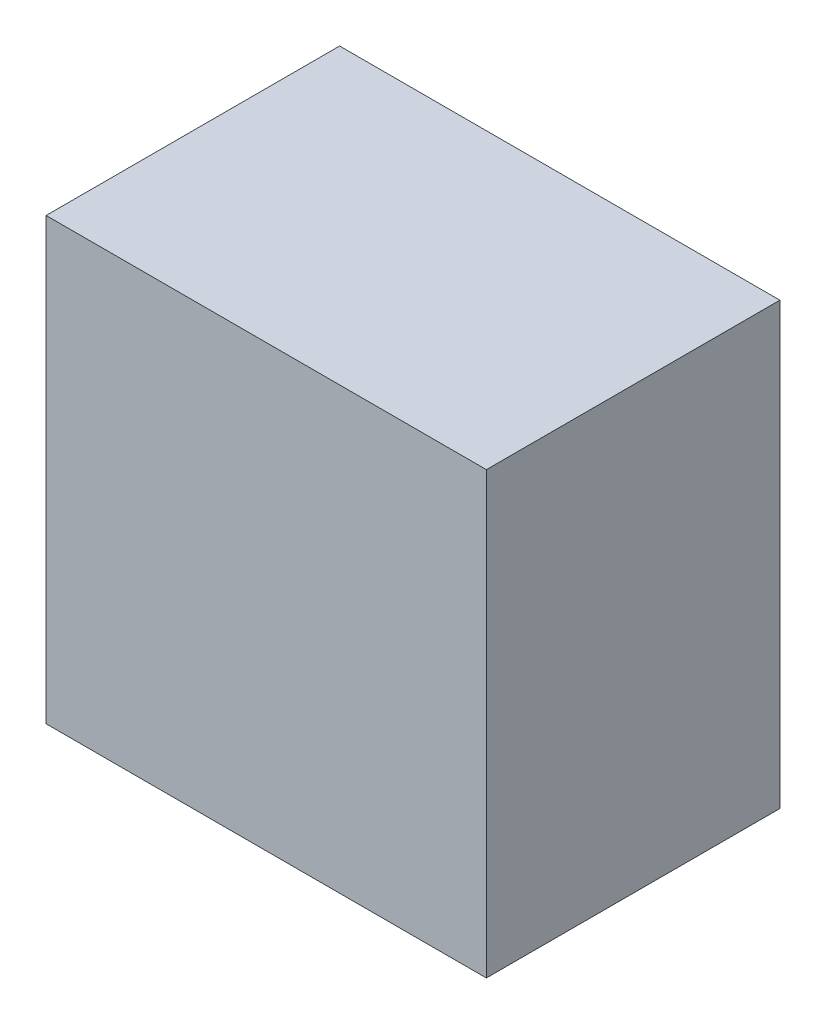
ISO-10303-21;
HEADER;
FILE_DESCRIPTION(('STEP AP214'),'2;1');
FILE_NAME('part.step','',(''),(''),'','','');
FILE_SCHEMA(('AUTOMOTIVE_DESIGN { 1 0 10303 214 1 1 1 1 }'));
ENDSEC;
DATA;
#1=APPLICATION_CONTEXT('core data for automotive mechanical design processes');
#2=APPLICATION_PROTOCOL_DEFINITION('international standard','automotive_design',2000,#1);
#3=PRODUCT_CONTEXT('',#1,'mechanical');
#4=PRODUCT('Part','Part','',(#3));
#5=PRODUCT_RELATED_PRODUCT_CATEGORY('part','',(#4));
#6=PRODUCT_DEFINITION_FORMATION('','',#4);
#7=PRODUCT_DEFINITION_CONTEXT('part definition',#1,'design');
#8=PRODUCT_DEFINITION('design','',#6,#7);
#9=PRODUCT_DEFINITION_SHAPE('','',#8);
#10=(LENGTH_UNIT() NAMED_UNIT(*) SI_UNIT(.MILLI.,.METRE.));
#11=(NAMED_UNIT(*) PLANE_ANGLE_UNIT() SI_UNIT($,.RADIAN.));
#12=(NAMED_UNIT(*) SI_UNIT($,.STERADIAN.) SOLID_ANGLE_UNIT());
#13=UNCERTAINTY_MEASURE_WITH_UNIT(LENGTH_MEASURE(1.E-05),#10,'distance_accuracy_value','');
#14=(GEOMETRIC_REPRESENTATION_CONTEXT(3) GLOBAL_UNCERTAINTY_ASSIGNED_CONTEXT((#13)) GLOBAL_UNIT_ASSIGNED_CONTEXT((#10,
#11,#12)) REPRESENTATION_CONTEXT('',''));
#15=CARTESIAN_POINT('',(0.,0.,0.));
#16=DIRECTION('',(0.,0.,1.));
#17=DIRECTION('',(1.,0.,0.));
#18=AXIS2_PLACEMENT_3D('',#15,#16,#17);
#19=CARTESIAN_POINT('',(0.,0.,0.));
#20=DIRECTION('',(0.,0.,1.));
#21=DIRECTION('',(1.,0.,0.));
#22=AXIS2_PLACEMENT_3D('',#19,#20,#21);
#23=PLANE('',#22);
#24=DIRECTION('',(0.,-1.,0.));
#25=VECTOR('',#24,1.);
#26=CARTESIAN_POINT('',(0.,0.,0.));
#27=LINE('',#26,#25);
#28=CARTESIAN_POINT('',(0.,0.,0.));
#29=VERTEX_POINT('',#28);
#30=CARTESIAN_POINT('',(0.,-15.,0.));
#31=VERTEX_POINT('',#30);
#32=EDGE_CURVE('E144',#29,#31,#27,.T.);
#33=ORIENTED_EDGE('',*,*,#32,.F.);
#34=DIRECTION('',(-1.,0.,0.));
#35=VECTOR('',#34,1.);
#36=CARTESIAN_POINT('',(0.,0.,0.));
#37=LINE('',#36,#35);
#38=CARTESIAN_POINT('',(15.,0.,0.));
#39=VERTEX_POINT('',#38);
#40=EDGE_CURVE('E87',#39,#29,#37,.T.);
#41=ORIENTED_EDGE('',*,*,#40,.F.);
#42=DIRECTION('',(0.,1.,0.));
#43=VECTOR('',#42,1.);
#44=CARTESIAN_POINT('',(15.,0.,0.));
#45=LINE('',#44,#43);
#46=CARTESIAN_POINT('',(15.,-15.,0.));
#47=VERTEX_POINT('',#46);
#48=EDGE_CURVE('E168',#47,#39,#45,.T.);
#49=ORIENTED_EDGE('',*,*,#48,.F.);
#50=DIRECTION('',(1.,0.,0.));
#51=VECTOR('',#50,1.);
#52=CARTESIAN_POINT('',(0.,-15.,0.));
#53=LINE('',#52,#51);
#54=EDGE_CURVE('E149',#31,#47,#53,.T.);
#55=ORIENTED_EDGE('',*,*,#54,.F.);
#56=EDGE_LOOP('',(#33,#41,#49,#55));
#57=FACE_BOUND('',#56,.T.);
#58=DIRECTION('',(0.,1.,0.));
#59=VECTOR('',#58,1.);
#60=CARTESIAN_POINT('',(6.,0.,0.));
#61=LINE('',#60,#59);
#62=CARTESIAN_POINT('',(6.,-10.,0.));
#63=VERTEX_POINT('',#62);
#64=CARTESIAN_POINT('',(6.,-5.,0.));
#65=VERTEX_POINT('',#64);
#66=EDGE_CURVE('E57',#63,#65,#61,.T.);
#67=ORIENTED_EDGE('',*,*,#66,.F.);
#68=DIRECTION('',(-1.,0.,0.));
#69=VECTOR('',#68,1.);
#70=CARTESIAN_POINT('',(9.,-10.,0.));
#71=LINE('',#70,#69);
#72=CARTESIAN_POINT('',(9.,-10.,0.));
#73=VERTEX_POINT('',#72);
#74=EDGE_CURVE('E151',#73,#63,#71,.T.);
#75=ORIENTED_EDGE('',*,*,#74,.F.);
#76=DIRECTION('',(0.,1.,0.));
#77=VECTOR('',#76,1.);
#78=CARTESIAN_POINT('',(9.,0.,0.));
#79=LINE('',#78,#77);
#80=CARTESIAN_POINT('',(9.,-5.,0.));
#81=VERTEX_POINT('',#80);
#82=EDGE_CURVE('E128',#73,#81,#79,.T.);
#83=ORIENTED_EDGE('',*,*,#82,.T.);
#84=DIRECTION('',(-1.,0.,0.));
#85=VECTOR('',#84,1.);
#86=CARTESIAN_POINT('',(9.,-5.,0.));
#87=LINE('',#86,#85);
#88=EDGE_CURVE('E124',#81,#65,#87,.T.);
#89=ORIENTED_EDGE('',*,*,#88,.T.);
#90=EDGE_LOOP('',(#67,#75,#83,#89));
#91=FACE_BOUND('',#90,.T.);
#92=ADVANCED_FACE('F41',(#57,#91),#23,.F.);
#93=CARTESIAN_POINT('',(0.,0.,10.));
#94=DIRECTION('',(1.,0.,0.));
#95=DIRECTION('',(0.,1.,0.));
#96=AXIS2_PLACEMENT_3D('',#93,#94,#95);
#97=PLANE('',#96);
#98=ORIENTED_EDGE('',*,*,#32,.T.);
#99=DIRECTION('',(0.,0.,-1.));
#100=VECTOR('',#99,1.);
#101=CARTESIAN_POINT('',(0.,-15.,10.));
#102=LINE('',#101,#100);
#103=CARTESIAN_POINT('',(0.,-15.,10.));
#104=VERTEX_POINT('',#103);
#105=EDGE_CURVE('E11',#104,#31,#102,.T.);
#106=ORIENTED_EDGE('',*,*,#105,.F.);
#107=DIRECTION('',(0.,-1.,0.));
#108=VECTOR('',#107,1.);
#109=CARTESIAN_POINT('',(0.,0.,10.));
#110=LINE('',#109,#108);
#111=CARTESIAN_POINT('',(0.,0.,10.));
#112=VERTEX_POINT('',#111);
#113=EDGE_CURVE('E155',#112,#104,#110,.T.);
#114=ORIENTED_EDGE('',*,*,#113,.F.);
#115=DIRECTION('',(0.,0.,-1.));
#116=VECTOR('',#115,1.);
#117=CARTESIAN_POINT('',(0.,0.,10.));
#118=LINE('',#117,#116);
#119=EDGE_CURVE('E164',#112,#29,#118,.T.);
#120=ORIENTED_EDGE('',*,*,#119,.T.);
#121=EDGE_LOOP('',(#98,#106,#114,#120));
#122=FACE_BOUND('',#121,.T.);
#123=ADVANCED_FACE('F43',(#122),#97,.F.);
#124=CARTESIAN_POINT('',(0.,-15.,10.));
#125=DIRECTION('',(0.,1.,0.));
#126=DIRECTION('',(0.,0.,1.));
#127=AXIS2_PLACEMENT_3D('',#124,#125,#126);
#128=PLANE('',#127);
#129=ORIENTED_EDGE('',*,*,#54,.T.);
#130=DIRECTION('',(0.,0.,-1.));
#131=VECTOR('',#130,1.);
#132=CARTESIAN_POINT('',(15.,-15.,10.));
#133=LINE('',#132,#131);
#134=CARTESIAN_POINT('',(15.,-15.,10.));
#135=VERTEX_POINT('',#134);
#136=EDGE_CURVE('E50',#135,#47,#133,.T.);
#137=ORIENTED_EDGE('',*,*,#136,.F.);
#138=DIRECTION('',(1.,0.,0.));
#139=VECTOR('',#138,1.);
#140=CARTESIAN_POINT('',(0.,-15.,10.));
#141=LINE('',#140,#139);
#142=EDGE_CURVE('E94',#104,#135,#141,.T.);
#143=ORIENTED_EDGE('',*,*,#142,.F.);
#144=ORIENTED_EDGE('',*,*,#105,.T.);
#145=EDGE_LOOP('',(#129,#137,#143,#144));
#146=FACE_BOUND('',#145,.T.);
#147=ADVANCED_FACE('F199',(#146),#128,.F.);
#148=CARTESIAN_POINT('',(15.,0.,10.));
#149=DIRECTION('',(-1.,0.,0.));
#150=DIRECTION('',(0.,-1.,0.));
#151=AXIS2_PLACEMENT_3D('',#148,#149,#150);
#152=PLANE('',#151);
#153=ORIENTED_EDGE('',*,*,#48,.T.);
#154=DIRECTION('',(0.,0.,-1.));
#155=VECTOR('',#154,1.);
#156=CARTESIAN_POINT('',(15.,0.,10.));
#157=LINE('',#156,#155);
#158=CARTESIAN_POINT('',(15.,0.,10.));
#159=VERTEX_POINT('',#158);
#160=EDGE_CURVE('E175',#159,#39,#157,.T.);
#161=ORIENTED_EDGE('',*,*,#160,.F.);
#162=DIRECTION('',(0.,1.,0.));
#163=VECTOR('',#162,1.);
#164=CARTESIAN_POINT('',(15.,0.,10.));
#165=LINE('',#164,#163);
#166=EDGE_CURVE('E160',#135,#159,#165,.T.);
#167=ORIENTED_EDGE('',*,*,#166,.F.);
#168=ORIENTED_EDGE('',*,*,#136,.T.);
#169=EDGE_LOOP('',(#153,#161,#167,#168));
#170=FACE_BOUND('',#169,.T.);
#171=ADVANCED_FACE('F182',(#170),#152,.F.);
#172=CARTESIAN_POINT('',(0.,0.,10.));
#173=DIRECTION('',(0.,-1.,0.));
#174=DIRECTION('',(0.,0.,-1.));
#175=AXIS2_PLACEMENT_3D('',#172,#173,#174);
#176=PLANE('',#175);
#177=ORIENTED_EDGE('',*,*,#40,.T.);
#178=ORIENTED_EDGE('',*,*,#119,.F.);
#179=DIRECTION('',(-1.,0.,0.));
#180=VECTOR('',#179,1.);
#181=CARTESIAN_POINT('',(0.,0.,10.));
#182=LINE('',#181,#180);
#183=EDGE_CURVE('E66',#159,#112,#182,.T.);
#184=ORIENTED_EDGE('',*,*,#183,.F.);
#185=ORIENTED_EDGE('',*,*,#160,.T.);
#186=EDGE_LOOP('',(#177,#178,#184,#185));
#187=FACE_BOUND('',#186,.T.);
#188=ADVANCED_FACE('F190',(#187),#176,.F.);
#189=CARTESIAN_POINT('',(0.,0.,10.));
#190=DIRECTION('',(0.,0.,1.));
#191=DIRECTION('',(1.,0.,0.));
#192=AXIS2_PLACEMENT_3D('',#189,#190,#191);
#193=PLANE('',#192);
#194=ORIENTED_EDGE('',*,*,#113,.T.);
#195=ORIENTED_EDGE('',*,*,#142,.T.);
#196=ORIENTED_EDGE('',*,*,#166,.T.);
#197=ORIENTED_EDGE('',*,*,#183,.T.);
#198=EDGE_LOOP('',(#194,#195,#196,#197));
#199=FACE_BOUND('',#198,.T.);
#200=ADVANCED_FACE('F192',(#199),#193,.T.);
#201=CARTESIAN_POINT('',(9.,-7.5,-3.));
#202=DIRECTION('',(-1.,0.,0.));
#203=DIRECTION('',(0.,-1.,0.));
#204=AXIS2_PLACEMENT_3D('',#201,#202,#203);
#205=CYLINDRICAL_SURFACE('',#204,2.5);
#206=CARTESIAN_POINT('',(6.,-7.5,-3.));
#207=DIRECTION('',(1.,0.,0.));
#208=DIRECTION('',(0.,1.,0.));
#209=AXIS2_PLACEMENT_3D('',#206,#207,#208);
#210=CIRCLE('',#209,2.5);
#211=CARTESIAN_POINT('',(6.,-10.,-3.));
#212=VERTEX_POINT('',#211);
#213=CARTESIAN_POINT('',(6.,-5.,-3.));
#214=VERTEX_POINT('',#213);
#215=EDGE_CURVE('E142',#212,#214,#210,.T.);
#216=ORIENTED_EDGE('',*,*,#215,.T.);
#217=DIRECTION('',(-1.,0.,0.));
#218=VECTOR('',#217,1.);
#219=CARTESIAN_POINT('',(9.,-5.,-3.));
#220=LINE('',#219,#218);
#221=CARTESIAN_POINT('',(9.,-5.,-3.));
#222=VERTEX_POINT('',#221);
#223=EDGE_CURVE('E121',#222,#214,#220,.T.);
#224=ORIENTED_EDGE('',*,*,#223,.F.);
#225=CARTESIAN_POINT('',(9.,-7.5,-3.));
#226=DIRECTION('',(1.,0.,0.));
#227=DIRECTION('',(0.,1.,0.));
#228=AXIS2_PLACEMENT_3D('',#225,#226,#227);
#229=CIRCLE('',#228,2.5);
#230=CARTESIAN_POINT('',(9.,-10.,-3.));
#231=VERTEX_POINT('',#230);
#232=EDGE_CURVE('E129',#231,#222,#229,.T.);
#233=ORIENTED_EDGE('',*,*,#232,.F.);
#234=DIRECTION('',(-1.,0.,0.));
#235=VECTOR('',#234,1.);
#236=CARTESIAN_POINT('',(9.,-10.,-3.));
#237=LINE('',#236,#235);
#238=EDGE_CURVE('E239',#231,#212,#237,.T.);
#239=ORIENTED_EDGE('',*,*,#238,.T.);
#240=EDGE_LOOP('',(#216,#224,#233,#239));
#241=FACE_BOUND('',#240,.T.);
#242=ADVANCED_FACE('F140',(#241),#205,.T.);
#243=CARTESIAN_POINT('',(9.,-5.,0.));
#244=DIRECTION('',(0.,-1.,0.));
#245=DIRECTION('',(1.,0.,0.));
#246=AXIS2_PLACEMENT_3D('',#243,#244,#245);
#247=PLANE('',#246);
#248=DIRECTION('',(0.,0.,1.));
#249=VECTOR('',#248,1.);
#250=CARTESIAN_POINT('',(6.,-5.,0.));
#251=LINE('',#250,#249);
#252=EDGE_CURVE('E246',#214,#65,#251,.T.);
#253=ORIENTED_EDGE('',*,*,#252,.T.);
#254=ORIENTED_EDGE('',*,*,#88,.F.);
#255=DIRECTION('',(0.,0.,1.));
#256=VECTOR('',#255,1.);
#257=CARTESIAN_POINT('',(9.,-5.,0.));
#258=LINE('',#257,#256);
#259=EDGE_CURVE('E117',#222,#81,#258,.T.);
#260=ORIENTED_EDGE('',*,*,#259,.F.);
#261=ORIENTED_EDGE('',*,*,#223,.T.);
#262=EDGE_LOOP('',(#253,#254,#260,#261));
#263=FACE_BOUND('',#262,.T.);
#264=ADVANCED_FACE('F119',(#263),#247,.F.);
#265=CARTESIAN_POINT('',(9.,-7.5,-3.));
#266=DIRECTION('',(-1.,0.,0.));
#267=DIRECTION('',(0.,-1.,0.));
#268=AXIS2_PLACEMENT_3D('',#265,#266,#267);
#269=CYLINDRICAL_SURFACE('',#268,1.);
#270=CARTESIAN_POINT('',(9.,-7.5,-3.));
#271=DIRECTION('',(1.,0.,0.));
#272=DIRECTION('',(0.,1.,0.));
#273=AXIS2_PLACEMENT_3D('',#270,#271,#272);
#274=CIRCLE('',#273,1.);
#275=CARTESIAN_POINT('',(9.,-6.5,-3.));
#276=VERTEX_POINT('',#275);
#277=EDGE_CURVE('E138',#276,#276,#274,.T.);
#278=ORIENTED_EDGE('',*,*,#277,.T.);
#279=EDGE_LOOP('',(#278));
#280=FACE_BOUND('',#279,.T.);
#281=CARTESIAN_POINT('',(6.,-7.5,-3.));
#282=DIRECTION('',(1.,0.,0.));
#283=DIRECTION('',(0.,1.,0.));
#284=AXIS2_PLACEMENT_3D('',#281,#282,#283);
#285=CIRCLE('',#284,1.);
#286=CARTESIAN_POINT('',(6.,-6.5,-3.));
#287=VERTEX_POINT('',#286);
#288=EDGE_CURVE('E240',#287,#287,#285,.T.);
#289=ORIENTED_EDGE('',*,*,#288,.F.);
#290=EDGE_LOOP('',(#289));
#291=FACE_BOUND('',#290,.T.);
#292=ADVANCED_FACE('F207',(#280,#291),#269,.F.);
#293=CARTESIAN_POINT('',(9.,-10.,0.));
#294=DIRECTION('',(0.,-1.,0.));
#295=DIRECTION('',(1.,0.,0.));
#296=AXIS2_PLACEMENT_3D('',#293,#294,#295);
#297=PLANE('',#296);
#298=DIRECTION('',(0.,0.,1.));
#299=VECTOR('',#298,1.);
#300=CARTESIAN_POINT('',(6.,-10.,0.));
#301=LINE('',#300,#299);
#302=EDGE_CURVE('E230',#212,#63,#301,.T.);
#303=ORIENTED_EDGE('',*,*,#302,.F.);
#304=ORIENTED_EDGE('',*,*,#238,.F.);
#305=DIRECTION('',(0.,0.,1.));
#306=VECTOR('',#305,1.);
#307=CARTESIAN_POINT('',(9.,-10.,0.));
#308=LINE('',#307,#306);
#309=EDGE_CURVE('E135',#231,#73,#308,.T.);
#310=ORIENTED_EDGE('',*,*,#309,.T.);
#311=ORIENTED_EDGE('',*,*,#74,.T.);
#312=EDGE_LOOP('',(#303,#304,#310,#311));
#313=FACE_BOUND('',#312,.T.);
#314=ADVANCED_FACE('F210',(#313),#297,.T.);
#315=CARTESIAN_POINT('',(9.,0.,0.));
#316=DIRECTION('',(1.,0.,0.));
#317=DIRECTION('',(0.,1.,0.));
#318=AXIS2_PLACEMENT_3D('',#315,#316,#317);
#319=PLANE('',#318);
#320=ORIENTED_EDGE('',*,*,#277,.F.);
#321=EDGE_LOOP('',(#320));
#322=FACE_BOUND('',#321,.T.);
#323=ORIENTED_EDGE('',*,*,#232,.T.);
#324=ORIENTED_EDGE('',*,*,#259,.T.);
#325=ORIENTED_EDGE('',*,*,#82,.F.);
#326=ORIENTED_EDGE('',*,*,#309,.F.);
#327=EDGE_LOOP('',(#323,#324,#325,#326));
#328=FACE_BOUND('',#327,.T.);
#329=ADVANCED_FACE('F133',(#322,#328),#319,.T.);
#330=CARTESIAN_POINT('',(6.,0.,0.));
#331=DIRECTION('',(1.,0.,0.));
#332=DIRECTION('',(0.,1.,0.));
#333=AXIS2_PLACEMENT_3D('',#330,#331,#332);
#334=PLANE('',#333);
#335=ORIENTED_EDGE('',*,*,#288,.T.);
#336=EDGE_LOOP('',(#335));
#337=FACE_BOUND('',#336,.T.);
#338=ORIENTED_EDGE('',*,*,#215,.F.);
#339=ORIENTED_EDGE('',*,*,#302,.T.);
#340=ORIENTED_EDGE('',*,*,#66,.T.);
#341=ORIENTED_EDGE('',*,*,#252,.F.);
#342=EDGE_LOOP('',(#338,#339,#340,#341));
#343=FACE_BOUND('',#342,.T.);
#344=ADVANCED_FACE('F219',(#337,#343),#334,.F.);
#345=CLOSED_SHELL('',(#92,#123,#147,#171,#188,#200,#242,#264,#292,#314,#329,#344));
#346=MANIFOLD_SOLID_BREP('B2',#345);
#347=ADVANCED_BREP_SHAPE_REPRESENTATION('',(#18,#346),#14);
#348=SHAPE_DEFINITION_REPRESENTATION(#9,#347);
ENDSEC;
END-ISO-10303-21;
